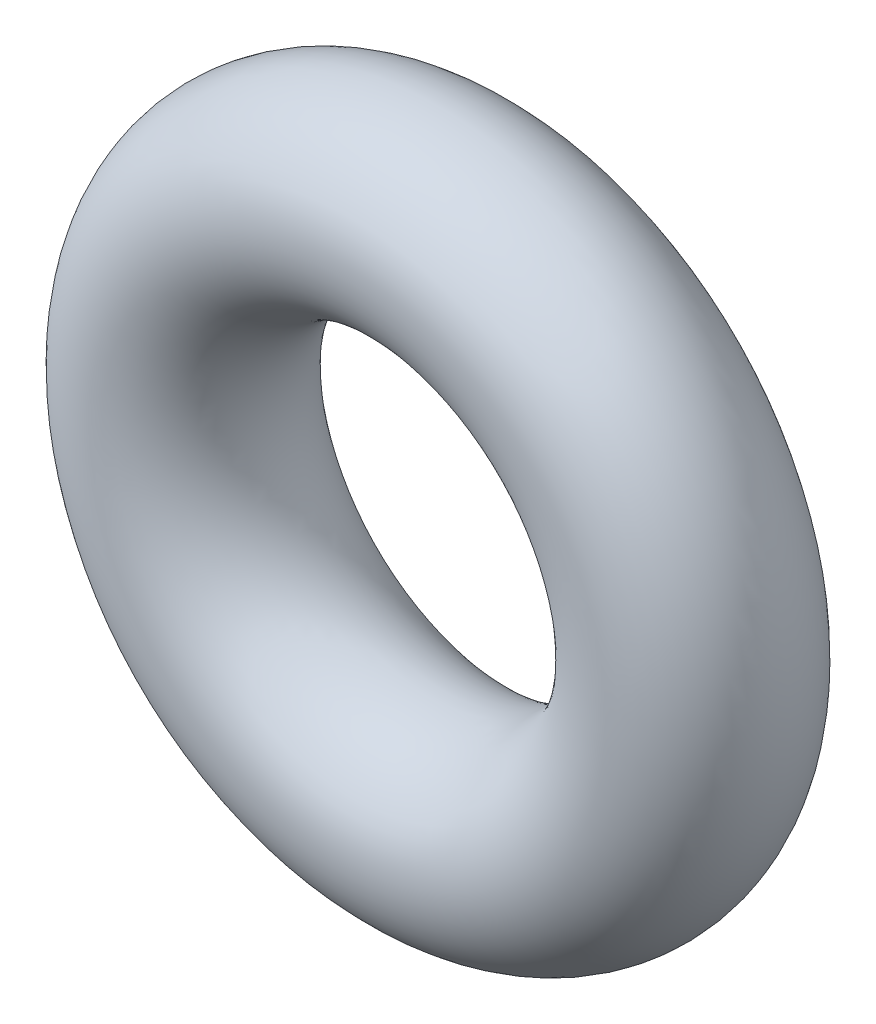
ISO-10303-21;
HEADER;
FILE_DESCRIPTION(('STEP AP214'),'2;1');
FILE_NAME('part.step','',(''),(''),'','','');
FILE_SCHEMA(('AUTOMOTIVE_DESIGN { 1 0 10303 214 1 1 1 1 }'));
ENDSEC;
DATA;
#1=APPLICATION_CONTEXT('core data for automotive mechanical design processes');
#2=APPLICATION_PROTOCOL_DEFINITION('international standard','automotive_design',2000,#1);
#3=PRODUCT_CONTEXT('',#1,'mechanical');
#4=PRODUCT('Part','Part','',(#3));
#5=PRODUCT_RELATED_PRODUCT_CATEGORY('part','',(#4));
#6=PRODUCT_DEFINITION_FORMATION('','',#4);
#7=PRODUCT_DEFINITION_CONTEXT('part definition',#1,'design');
#8=PRODUCT_DEFINITION('design','',#6,#7);
#9=PRODUCT_DEFINITION_SHAPE('','',#8);
#10=(LENGTH_UNIT() NAMED_UNIT(*) SI_UNIT(.MILLI.,.METRE.));
#11=(NAMED_UNIT(*) PLANE_ANGLE_UNIT() SI_UNIT($,.RADIAN.));
#12=(NAMED_UNIT(*) SI_UNIT($,.STERADIAN.) SOLID_ANGLE_UNIT());
#13=UNCERTAINTY_MEASURE_WITH_UNIT(LENGTH_MEASURE(1.E-05),#10,'distance_accuracy_value','');
#14=(GEOMETRIC_REPRESENTATION_CONTEXT(3) GLOBAL_UNCERTAINTY_ASSIGNED_CONTEXT((#13)) GLOBAL_UNIT_ASSIGNED_CONTEXT((#10,
#11,#12)) REPRESENTATION_CONTEXT('',''));
#15=CARTESIAN_POINT('',(0.,0.,0.));
#16=DIRECTION('',(0.,0.,1.));
#17=DIRECTION('',(1.,0.,0.));
#18=AXIS2_PLACEMENT_3D('',#15,#16,#17);
#19=CARTESIAN_POINT('',(0.,0.,0.));
#20=DIRECTION('',(0.,0.,1.));
#21=DIRECTION('',(1.,0.,0.));
#22=AXIS2_PLACEMENT_3D('',#19,#20,#21);
#23=TOROIDAL_SURFACE('',#22,2.3368,0.888999999999999);
#24=CARTESIAN_POINT('',(3.2258,0.,0.));
#25=VERTEX_POINT('',#24);
#26=VERTEX_LOOP('',#25);
#27=FACE_BOUND('',#26,.T.);
#28=ADVANCED_FACE('F35',(#27),#23,.T.);
#29=CLOSED_SHELL('',(#28));
#30=MANIFOLD_SOLID_BREP('B2',#29);
#31=ADVANCED_BREP_SHAPE_REPRESENTATION('',(#18,#30),#14);
#32=SHAPE_DEFINITION_REPRESENTATION(#9,#31);
ENDSEC;
END-ISO-10303-21;
